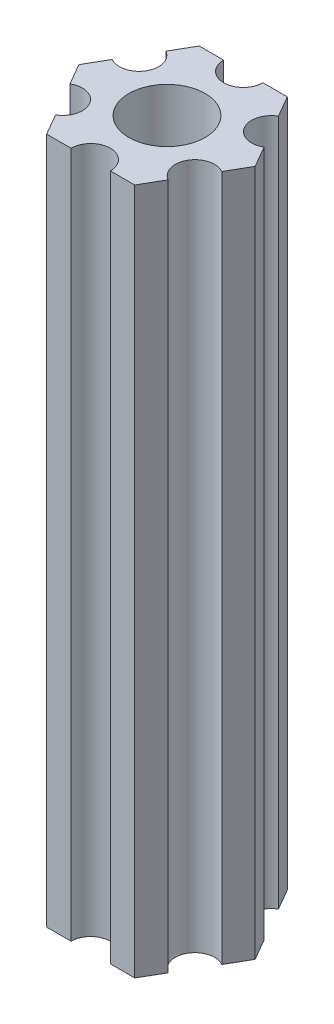
ISO-10303-21;
HEADER;
FILE_DESCRIPTION(('STEP AP214'),'2;1');
FILE_NAME('part.step','',(''),(''),'','','');
FILE_SCHEMA(('AUTOMOTIVE_DESIGN { 1 0 10303 214 1 1 1 1 }'));
ENDSEC;
DATA;
#1=APPLICATION_CONTEXT('core data for automotive mechanical design processes');
#2=APPLICATION_PROTOCOL_DEFINITION('international standard','automotive_design',2000,#1);
#3=PRODUCT_CONTEXT('',#1,'mechanical');
#4=PRODUCT('Part','Part','',(#3));
#5=PRODUCT_RELATED_PRODUCT_CATEGORY('part','',(#4));
#6=PRODUCT_DEFINITION_FORMATION('','',#4);
#7=PRODUCT_DEFINITION_CONTEXT('part definition',#1,'design');
#8=PRODUCT_DEFINITION('design','',#6,#7);
#9=PRODUCT_DEFINITION_SHAPE('','',#8);
#10=(LENGTH_UNIT() NAMED_UNIT(*) SI_UNIT(.MILLI.,.METRE.));
#11=(NAMED_UNIT(*) PLANE_ANGLE_UNIT() SI_UNIT($,.RADIAN.));
#12=(NAMED_UNIT(*) SI_UNIT($,.STERADIAN.) SOLID_ANGLE_UNIT());
#13=UNCERTAINTY_MEASURE_WITH_UNIT(LENGTH_MEASURE(1.E-05),#10,'distance_accuracy_value','');
#14=(GEOMETRIC_REPRESENTATION_CONTEXT(3) GLOBAL_UNCERTAINTY_ASSIGNED_CONTEXT((#13)) GLOBAL_UNIT_ASSIGNED_CONTEXT((#10,
#11,#12)) REPRESENTATION_CONTEXT('',''));
#15=CARTESIAN_POINT('',(0.,0.,0.));
#16=DIRECTION('',(0.,0.,1.));
#17=DIRECTION('',(1.,0.,0.));
#18=AXIS2_PLACEMENT_3D('',#15,#16,#17);
#19=CARTESIAN_POINT('',(-5.49926131403119,0.,-3.175));
#20=DIRECTION('',(0.,-1.,0.));
#21=DIRECTION('',(0.,0.,-1.));
#22=AXIS2_PLACEMENT_3D('',#19,#20,#21);
#23=CYLINDRICAL_SURFACE('',#22,1.63417420935412);
#24=CARTESIAN_POINT('',(-5.49926131403119,-57.15,-3.175));
#25=DIRECTION('',(0.,1.,0.));
#26=DIRECTION('',(0.,0.,1.));
#27=AXIS2_PLACEMENT_3D('',#24,#25,#26);
#28=CIRCLE('',#27,1.63417420935412);
#29=CARTESIAN_POINT('',(-6.31634841870825,-57.15,-1.75976362048998));
#30=VERTEX_POINT('',#29);
#31=CARTESIAN_POINT('',(-4.68217420935413,-57.15,-4.59023637951002));
#32=VERTEX_POINT('',#31);
#33=EDGE_CURVE('E206',#30,#32,#28,.T.);
#34=ORIENTED_EDGE('',*,*,#33,.F.);
#35=DIRECTION('',(0.,-1.,0.));
#36=VECTOR('',#35,1.);
#37=CARTESIAN_POINT('',(-6.31634841870825,0.,-1.75976362048998));
#38=LINE('',#37,#36);
#39=CARTESIAN_POINT('',(-6.31634841870825,0.,-1.75976362048998));
#40=VERTEX_POINT('',#39);
#41=EDGE_CURVE('E11',#40,#30,#38,.T.);
#42=ORIENTED_EDGE('',*,*,#41,.F.);
#43=CARTESIAN_POINT('',(-5.49926131403119,0.,-3.175));
#44=DIRECTION('',(0.,1.,0.));
#45=DIRECTION('',(0.,0.,1.));
#46=AXIS2_PLACEMENT_3D('',#43,#44,#45);
#47=CIRCLE('',#46,1.63417420935412);
#48=CARTESIAN_POINT('',(-4.68217420935413,0.,-4.59023637951002));
#49=VERTEX_POINT('',#48);
#50=EDGE_CURVE('E275',#40,#49,#47,.T.);
#51=ORIENTED_EDGE('',*,*,#50,.T.);
#52=DIRECTION('',(0.,-1.,0.));
#53=VECTOR('',#52,1.);
#54=CARTESIAN_POINT('',(-4.68217420935413,0.,-4.59023637951002));
#55=LINE('',#54,#53);
#56=EDGE_CURVE('E46',#49,#32,#55,.T.);
#57=ORIENTED_EDGE('',*,*,#56,.T.);
#58=EDGE_LOOP('',(#34,#42,#51,#57));
#59=FACE_BOUND('',#58,.T.);
#60=ADVANCED_FACE('F43',(#59),#23,.F.);
#61=CARTESIAN_POINT('',(-7.33234841870825,0.,0.));
#62=DIRECTION('',(-0.866025403784439,0.,-0.5));
#63=DIRECTION('',(-0.5,0.,0.866025403784439));
#64=AXIS2_PLACEMENT_3D('',#61,#62,#63);
#65=PLANE('',#64);
#66=DIRECTION('',(0.5,0.,-0.866025403784439));
#67=VECTOR('',#66,1.);
#68=CARTESIAN_POINT('',(-7.33234841870825,-57.15,0.));
#69=LINE('',#68,#67);
#70=CARTESIAN_POINT('',(-7.33234841870825,-57.15,0.));
#71=VERTEX_POINT('',#70);
#72=EDGE_CURVE('E272',#71,#30,#69,.T.);
#73=ORIENTED_EDGE('',*,*,#72,.F.);
#74=DIRECTION('',(0.,-1.,0.));
#75=VECTOR('',#74,1.);
#76=CARTESIAN_POINT('',(-7.33234841870825,0.,0.));
#77=LINE('',#76,#75);
#78=CARTESIAN_POINT('',(-7.33234841870825,0.,0.));
#79=VERTEX_POINT('',#78);
#80=EDGE_CURVE('E53',#79,#71,#77,.T.);
#81=ORIENTED_EDGE('',*,*,#80,.F.);
#82=DIRECTION('',(0.5,0.,-0.866025403784439));
#83=VECTOR('',#82,1.);
#84=CARTESIAN_POINT('',(-7.33234841870825,0.,0.));
#85=LINE('',#84,#83);
#86=EDGE_CURVE('E192',#79,#40,#85,.T.);
#87=ORIENTED_EDGE('',*,*,#86,.T.);
#88=ORIENTED_EDGE('',*,*,#41,.T.);
#89=EDGE_LOOP('',(#73,#81,#87,#88));
#90=FACE_BOUND('',#89,.T.);
#91=ADVANCED_FACE('F323',(#90),#65,.T.);
#92=CARTESIAN_POINT('',(-6.31634841870825,0.,1.75976362048998));
#93=DIRECTION('',(-0.866025403784439,0.,0.499999999999999));
#94=DIRECTION('',(0.499999999999999,0.,0.866025403784439));
#95=AXIS2_PLACEMENT_3D('',#92,#93,#94);
#96=PLANE('',#95);
#97=DIRECTION('',(-0.499999999999999,0.,-0.866025403784439));
#98=VECTOR('',#97,1.);
#99=CARTESIAN_POINT('',(-6.31634841870825,-57.15,1.75976362048998));
#100=LINE('',#99,#98);
#101=CARTESIAN_POINT('',(-6.31634841870825,-57.15,1.75976362048998));
#102=VERTEX_POINT('',#101);
#103=EDGE_CURVE('E178',#102,#71,#100,.T.);
#104=ORIENTED_EDGE('',*,*,#103,.F.);
#105=DIRECTION('',(0.,-1.,0.));
#106=VECTOR('',#105,1.);
#107=CARTESIAN_POINT('',(-6.31634841870825,0.,1.75976362048998));
#108=LINE('',#107,#106);
#109=CARTESIAN_POINT('',(-6.31634841870825,0.,1.75976362048998));
#110=VERTEX_POINT('',#109);
#111=EDGE_CURVE('E173',#110,#102,#108,.T.);
#112=ORIENTED_EDGE('',*,*,#111,.F.);
#113=DIRECTION('',(-0.499999999999999,0.,-0.866025403784439));
#114=VECTOR('',#113,1.);
#115=CARTESIAN_POINT('',(-6.31634841870825,0.,1.75976362048998));
#116=LINE('',#115,#114);
#117=EDGE_CURVE('E176',#110,#79,#116,.T.);
#118=ORIENTED_EDGE('',*,*,#117,.T.);
#119=ORIENTED_EDGE('',*,*,#80,.T.);
#120=EDGE_LOOP('',(#104,#112,#118,#119));
#121=FACE_BOUND('',#120,.T.);
#122=ADVANCED_FACE('F175',(#121),#96,.T.);
#123=CARTESIAN_POINT('',(-5.49926131403119,0.,3.175));
#124=DIRECTION('',(0.,-1.,0.));
#125=DIRECTION('',(0.,0.,-1.));
#126=AXIS2_PLACEMENT_3D('',#123,#124,#125);
#127=CYLINDRICAL_SURFACE('',#126,1.63417420935412);
#128=CARTESIAN_POINT('',(-5.49926131403119,-57.15,3.175));
#129=DIRECTION('',(0.,1.,0.));
#130=DIRECTION('',(0.,0.,1.));
#131=AXIS2_PLACEMENT_3D('',#128,#129,#130);
#132=CIRCLE('',#131,1.63417420935412);
#133=CARTESIAN_POINT('',(-4.68217420935413,-57.15,4.59023637951002));
#134=VERTEX_POINT('',#133);
#135=EDGE_CURVE('E267',#134,#102,#132,.T.);
#136=ORIENTED_EDGE('',*,*,#135,.F.);
#137=DIRECTION('',(0.,-1.,0.));
#138=VECTOR('',#137,1.);
#139=CARTESIAN_POINT('',(-4.68217420935413,0.,4.59023637951002));
#140=LINE('',#139,#138);
#141=CARTESIAN_POINT('',(-4.68217420935413,0.,4.59023637951002));
#142=VERTEX_POINT('',#141);
#143=EDGE_CURVE('E184',#142,#134,#140,.T.);
#144=ORIENTED_EDGE('',*,*,#143,.F.);
#145=CARTESIAN_POINT('',(-5.49926131403119,0.,3.175));
#146=DIRECTION('',(0.,1.,0.));
#147=DIRECTION('',(0.,0.,1.));
#148=AXIS2_PLACEMENT_3D('',#145,#146,#147);
#149=CIRCLE('',#148,1.63417420935412);
#150=EDGE_CURVE('E190',#142,#110,#149,.T.);
#151=ORIENTED_EDGE('',*,*,#150,.T.);
#152=ORIENTED_EDGE('',*,*,#111,.T.);
#153=EDGE_LOOP('',(#136,#144,#151,#152));
#154=FACE_BOUND('',#153,.T.);
#155=ADVANCED_FACE('F195',(#154),#127,.F.);
#156=CARTESIAN_POINT('',(-3.66617420935412,0.,6.35));
#157=DIRECTION('',(-0.866025403784438,0.,0.500000000000002));
#158=DIRECTION('',(0.500000000000002,0.,0.866025403784438));
#159=AXIS2_PLACEMENT_3D('',#156,#157,#158);
#160=PLANE('',#159);
#161=DIRECTION('',(-0.500000000000002,0.,-0.866025403784437));
#162=VECTOR('',#161,1.);
#163=CARTESIAN_POINT('',(-3.66617420935412,-57.15,6.35));
#164=LINE('',#163,#162);
#165=CARTESIAN_POINT('',(-3.66617420935412,-57.15,6.35));
#166=VERTEX_POINT('',#165);
#167=EDGE_CURVE('E263',#166,#134,#164,.T.);
#168=ORIENTED_EDGE('',*,*,#167,.F.);
#169=DIRECTION('',(0.,-1.,0.));
#170=VECTOR('',#169,1.);
#171=CARTESIAN_POINT('',(-3.66617420935412,0.,6.35));
#172=LINE('',#171,#170);
#173=CARTESIAN_POINT('',(-3.66617420935412,0.,6.35));
#174=VERTEX_POINT('',#173);
#175=EDGE_CURVE('E281',#174,#166,#172,.T.);
#176=ORIENTED_EDGE('',*,*,#175,.F.);
#177=DIRECTION('',(-0.500000000000002,0.,-0.866025403784437));
#178=VECTOR('',#177,1.);
#179=CARTESIAN_POINT('',(-3.66617420935412,0.,6.35));
#180=LINE('',#179,#178);
#181=EDGE_CURVE('E197',#174,#142,#180,.T.);
#182=ORIENTED_EDGE('',*,*,#181,.T.);
#183=ORIENTED_EDGE('',*,*,#143,.T.);
#184=EDGE_LOOP('',(#168,#176,#182,#183));
#185=FACE_BOUND('',#184,.T.);
#186=ADVANCED_FACE('F336',(#185),#160,.T.);
#187=CARTESIAN_POINT('',(-1.63417420935412,0.,6.35));
#188=DIRECTION('',(0.,0.,1.));
#189=DIRECTION('',(1.,0.,0.));
#190=AXIS2_PLACEMENT_3D('',#187,#188,#189);
#191=PLANE('',#190);
#192=DIRECTION('',(-1.,0.,0.));
#193=VECTOR('',#192,1.);
#194=CARTESIAN_POINT('',(-1.63417420935412,-57.15,6.35));
#195=LINE('',#194,#193);
#196=CARTESIAN_POINT('',(-1.63417420935412,-57.15,6.35));
#197=VERTEX_POINT('',#196);
#198=EDGE_CURVE('E259',#197,#166,#195,.T.);
#199=ORIENTED_EDGE('',*,*,#198,.F.);
#200=DIRECTION('',(0.,-1.,0.));
#201=VECTOR('',#200,1.);
#202=CARTESIAN_POINT('',(-1.63417420935412,0.,6.35));
#203=LINE('',#202,#201);
#204=CARTESIAN_POINT('',(-1.63417420935412,0.,6.35));
#205=VERTEX_POINT('',#204);
#206=EDGE_CURVE('E284',#205,#197,#203,.T.);
#207=ORIENTED_EDGE('',*,*,#206,.F.);
#208=DIRECTION('',(-1.,0.,0.));
#209=VECTOR('',#208,1.);
#210=CARTESIAN_POINT('',(-1.63417420935412,0.,6.35));
#211=LINE('',#210,#209);
#212=EDGE_CURVE('E200',#205,#174,#211,.T.);
#213=ORIENTED_EDGE('',*,*,#212,.T.);
#214=ORIENTED_EDGE('',*,*,#175,.T.);
#215=EDGE_LOOP('',(#199,#207,#213,#214));
#216=FACE_BOUND('',#215,.T.);
#217=ADVANCED_FACE('F339',(#216),#191,.T.);
#218=CARTESIAN_POINT('',(0.,0.,6.35));
#219=DIRECTION('',(0.,-1.,0.));
#220=DIRECTION('',(0.,0.,-1.));
#221=AXIS2_PLACEMENT_3D('',#218,#219,#220);
#222=CYLINDRICAL_SURFACE('',#221,1.63417420935412);
#223=CARTESIAN_POINT('',(0.,-57.15,6.35));
#224=DIRECTION('',(0.,1.,0.));
#225=DIRECTION('',(0.,0.,1.));
#226=AXIS2_PLACEMENT_3D('',#223,#224,#225);
#227=CIRCLE('',#226,1.63417420935412);
#228=CARTESIAN_POINT('',(1.63417420935412,-57.15,6.35));
#229=VERTEX_POINT('',#228);
#230=EDGE_CURVE('E255',#229,#197,#227,.T.);
#231=ORIENTED_EDGE('',*,*,#230,.F.);
#232=DIRECTION('',(0.,-1.,0.));
#233=VECTOR('',#232,1.);
#234=CARTESIAN_POINT('',(1.63417420935412,0.,6.35));
#235=LINE('',#234,#233);
#236=CARTESIAN_POINT('',(1.63417420935412,0.,6.35));
#237=VERTEX_POINT('',#236);
#238=EDGE_CURVE('E287',#237,#229,#235,.T.);
#239=ORIENTED_EDGE('',*,*,#238,.F.);
#240=CARTESIAN_POINT('',(0.,0.,6.35));
#241=DIRECTION('',(0.,1.,0.));
#242=DIRECTION('',(0.,0.,1.));
#243=AXIS2_PLACEMENT_3D('',#240,#241,#242);
#244=CIRCLE('',#243,1.63417420935412);
#245=EDGE_CURVE('E458',#237,#205,#244,.T.);
#246=ORIENTED_EDGE('',*,*,#245,.T.);
#247=ORIENTED_EDGE('',*,*,#206,.T.);
#248=EDGE_LOOP('',(#231,#239,#246,#247));
#249=FACE_BOUND('',#248,.T.);
#250=ADVANCED_FACE('F343',(#249),#222,.F.);
#251=CARTESIAN_POINT('',(3.66617420935412,0.,6.35));
#252=DIRECTION('',(0.,0.,1.));
#253=DIRECTION('',(1.,0.,0.));
#254=AXIS2_PLACEMENT_3D('',#251,#252,#253);
#255=PLANE('',#254);
#256=DIRECTION('',(-1.,0.,0.));
#257=VECTOR('',#256,1.);
#258=CARTESIAN_POINT('',(3.66617420935412,-57.15,6.35));
#259=LINE('',#258,#257);
#260=CARTESIAN_POINT('',(3.66617420935412,-57.15,6.35));
#261=VERTEX_POINT('',#260);
#262=EDGE_CURVE('E251',#261,#229,#259,.T.);
#263=ORIENTED_EDGE('',*,*,#262,.F.);
#264=DIRECTION('',(0.,-1.,0.));
#265=VECTOR('',#264,1.);
#266=CARTESIAN_POINT('',(3.66617420935412,0.,6.35));
#267=LINE('',#266,#265);
#268=CARTESIAN_POINT('',(3.66617420935412,0.,6.35));
#269=VERTEX_POINT('',#268);
#270=EDGE_CURVE('E290',#269,#261,#267,.T.);
#271=ORIENTED_EDGE('',*,*,#270,.F.);
#272=DIRECTION('',(-1.,0.,0.));
#273=VECTOR('',#272,1.);
#274=CARTESIAN_POINT('',(3.66617420935412,0.,6.35));
#275=LINE('',#274,#273);
#276=EDGE_CURVE('E454',#269,#237,#275,.T.);
#277=ORIENTED_EDGE('',*,*,#276,.T.);
#278=ORIENTED_EDGE('',*,*,#238,.T.);
#279=EDGE_LOOP('',(#263,#271,#277,#278));
#280=FACE_BOUND('',#279,.T.);
#281=ADVANCED_FACE('F347',(#280),#255,.T.);
#282=CARTESIAN_POINT('',(4.68217420935412,0.,4.59023637951002));
#283=DIRECTION('',(0.866025403784439,0.,0.5));
#284=DIRECTION('',(0.5,0.,-0.866025403784439));
#285=AXIS2_PLACEMENT_3D('',#282,#283,#284);
#286=PLANE('',#285);
#287=DIRECTION('',(-0.5,0.,0.866025403784439));
#288=VECTOR('',#287,1.);
#289=CARTESIAN_POINT('',(4.68217420935412,-57.15,4.59023637951002));
#290=LINE('',#289,#288);
#291=CARTESIAN_POINT('',(4.68217420935412,-57.15,4.59023637951002));
#292=VERTEX_POINT('',#291);
#293=EDGE_CURVE('E247',#292,#261,#290,.T.);
#294=ORIENTED_EDGE('',*,*,#293,.F.);
#295=DIRECTION('',(0.,-1.,0.));
#296=VECTOR('',#295,1.);
#297=CARTESIAN_POINT('',(4.68217420935412,0.,4.59023637951002));
#298=LINE('',#297,#296);
#299=CARTESIAN_POINT('',(4.68217420935412,0.,4.59023637951002));
#300=VERTEX_POINT('',#299);
#301=EDGE_CURVE('E293',#300,#292,#298,.T.);
#302=ORIENTED_EDGE('',*,*,#301,.F.);
#303=DIRECTION('',(-0.5,0.,0.866025403784439));
#304=VECTOR('',#303,1.);
#305=CARTESIAN_POINT('',(4.68217420935412,0.,4.59023637951002));
#306=LINE('',#305,#304);
#307=EDGE_CURVE('E450',#300,#269,#306,.T.);
#308=ORIENTED_EDGE('',*,*,#307,.T.);
#309=ORIENTED_EDGE('',*,*,#270,.T.);
#310=EDGE_LOOP('',(#294,#302,#308,#309));
#311=FACE_BOUND('',#310,.T.);
#312=ADVANCED_FACE('F351',(#311),#286,.T.);
#313=CARTESIAN_POINT('',(5.49926131403119,0.,3.175));
#314=DIRECTION('',(0.,-1.,0.));
#315=DIRECTION('',(0.,0.,-1.));
#316=AXIS2_PLACEMENT_3D('',#313,#314,#315);
#317=CYLINDRICAL_SURFACE('',#316,1.63417420935413);
#318=CARTESIAN_POINT('',(5.49926131403119,-57.15,3.175));
#319=DIRECTION('',(0.,1.,0.));
#320=DIRECTION('',(0.,0.,1.));
#321=AXIS2_PLACEMENT_3D('',#318,#319,#320);
#322=CIRCLE('',#321,1.63417420935413);
#323=CARTESIAN_POINT('',(6.31634841870825,-57.15,1.75976362048998));
#324=VERTEX_POINT('',#323);
#325=EDGE_CURVE('E243',#324,#292,#322,.T.);
#326=ORIENTED_EDGE('',*,*,#325,.F.);
#327=DIRECTION('',(0.,-1.,0.));
#328=VECTOR('',#327,1.);
#329=CARTESIAN_POINT('',(6.31634841870825,0.,1.75976362048998));
#330=LINE('',#329,#328);
#331=CARTESIAN_POINT('',(6.31634841870825,0.,1.75976362048998));
#332=VERTEX_POINT('',#331);
#333=EDGE_CURVE('E296',#332,#324,#330,.T.);
#334=ORIENTED_EDGE('',*,*,#333,.F.);
#335=CARTESIAN_POINT('',(5.49926131403119,0.,3.175));
#336=DIRECTION('',(0.,1.,0.));
#337=DIRECTION('',(0.,0.,1.));
#338=AXIS2_PLACEMENT_3D('',#335,#336,#337);
#339=CIRCLE('',#338,1.63417420935413);
#340=EDGE_CURVE('E446',#332,#300,#339,.T.);
#341=ORIENTED_EDGE('',*,*,#340,.T.);
#342=ORIENTED_EDGE('',*,*,#301,.T.);
#343=EDGE_LOOP('',(#326,#334,#341,#342));
#344=FACE_BOUND('',#343,.T.);
#345=ADVANCED_FACE('F355',(#344),#317,.F.);
#346=CARTESIAN_POINT('',(7.33234841870825,0.,0.));
#347=DIRECTION('',(0.866025403784439,0.,0.5));
#348=DIRECTION('',(0.5,0.,-0.866025403784438));
#349=AXIS2_PLACEMENT_3D('',#346,#347,#348);
#350=PLANE('',#349);
#351=DIRECTION('',(-0.5,0.,0.866025403784438));
#352=VECTOR('',#351,1.);
#353=CARTESIAN_POINT('',(7.33234841870825,-57.15,0.));
#354=LINE('',#353,#352);
#355=CARTESIAN_POINT('',(7.33234841870825,-57.15,0.));
#356=VERTEX_POINT('',#355);
#357=EDGE_CURVE('E239',#356,#324,#354,.T.);
#358=ORIENTED_EDGE('',*,*,#357,.F.);
#359=DIRECTION('',(0.,-1.,0.));
#360=VECTOR('',#359,1.);
#361=CARTESIAN_POINT('',(7.33234841870825,0.,0.));
#362=LINE('',#361,#360);
#363=CARTESIAN_POINT('',(7.33234841870825,0.,0.));
#364=VERTEX_POINT('',#363);
#365=EDGE_CURVE('E299',#364,#356,#362,.T.);
#366=ORIENTED_EDGE('',*,*,#365,.F.);
#367=DIRECTION('',(-0.5,0.,0.866025403784438));
#368=VECTOR('',#367,1.);
#369=CARTESIAN_POINT('',(7.33234841870825,0.,0.));
#370=LINE('',#369,#368);
#371=EDGE_CURVE('E442',#364,#332,#370,.T.);
#372=ORIENTED_EDGE('',*,*,#371,.T.);
#373=ORIENTED_EDGE('',*,*,#333,.T.);
#374=EDGE_LOOP('',(#358,#366,#372,#373));
#375=FACE_BOUND('',#374,.T.);
#376=ADVANCED_FACE('F359',(#375),#350,.T.);
#377=CARTESIAN_POINT('',(6.31634841870825,0.,-1.75976362048998));
#378=DIRECTION('',(0.866025403784439,0.,-0.499999999999999));
#379=DIRECTION('',(-0.499999999999999,0.,-0.866025403784439));
#380=AXIS2_PLACEMENT_3D('',#377,#378,#379);
#381=PLANE('',#380);
#382=DIRECTION('',(0.499999999999999,0.,0.866025403784439));
#383=VECTOR('',#382,1.);
#384=CARTESIAN_POINT('',(6.31634841870825,-57.15,-1.75976362048998));
#385=LINE('',#384,#383);
#386=CARTESIAN_POINT('',(6.31634841870825,-57.15,-1.75976362048998));
#387=VERTEX_POINT('',#386);
#388=EDGE_CURVE('E235',#387,#356,#385,.T.);
#389=ORIENTED_EDGE('',*,*,#388,.F.);
#390=DIRECTION('',(0.,-1.,0.));
#391=VECTOR('',#390,1.);
#392=CARTESIAN_POINT('',(6.31634841870825,0.,-1.75976362048998));
#393=LINE('',#392,#391);
#394=CARTESIAN_POINT('',(6.31634841870825,0.,-1.75976362048998));
#395=VERTEX_POINT('',#394);
#396=EDGE_CURVE('E302',#395,#387,#393,.T.);
#397=ORIENTED_EDGE('',*,*,#396,.F.);
#398=DIRECTION('',(0.499999999999999,0.,0.866025403784439));
#399=VECTOR('',#398,1.);
#400=CARTESIAN_POINT('',(6.31634841870825,0.,-1.75976362048998));
#401=LINE('',#400,#399);
#402=EDGE_CURVE('E438',#395,#364,#401,.T.);
#403=ORIENTED_EDGE('',*,*,#402,.T.);
#404=ORIENTED_EDGE('',*,*,#365,.T.);
#405=EDGE_LOOP('',(#389,#397,#403,#404));
#406=FACE_BOUND('',#405,.T.);
#407=ADVANCED_FACE('F363',(#406),#381,.T.);
#408=CARTESIAN_POINT('',(5.49926131403119,0.,-3.175));
#409=DIRECTION('',(0.,-1.,0.));
#410=DIRECTION('',(0.,0.,-1.));
#411=AXIS2_PLACEMENT_3D('',#408,#409,#410);
#412=CYLINDRICAL_SURFACE('',#411,1.63417420935412);
#413=CARTESIAN_POINT('',(5.49926131403119,-57.15,-3.175));
#414=DIRECTION('',(0.,1.,0.));
#415=DIRECTION('',(0.,0.,1.));
#416=AXIS2_PLACEMENT_3D('',#413,#414,#415);
#417=CIRCLE('',#416,1.63417420935412);
#418=CARTESIAN_POINT('',(4.68217420935413,-57.15,-4.59023637951002));
#419=VERTEX_POINT('',#418);
#420=EDGE_CURVE('E231',#419,#387,#417,.T.);
#421=ORIENTED_EDGE('',*,*,#420,.F.);
#422=DIRECTION('',(0.,-1.,0.));
#423=VECTOR('',#422,1.);
#424=CARTESIAN_POINT('',(4.68217420935413,0.,-4.59023637951002));
#425=LINE('',#424,#423);
#426=CARTESIAN_POINT('',(4.68217420935413,0.,-4.59023637951002));
#427=VERTEX_POINT('',#426);
#428=EDGE_CURVE('E305',#427,#419,#425,.T.);
#429=ORIENTED_EDGE('',*,*,#428,.F.);
#430=CARTESIAN_POINT('',(5.49926131403119,0.,-3.175));
#431=DIRECTION('',(0.,1.,0.));
#432=DIRECTION('',(0.,0.,1.));
#433=AXIS2_PLACEMENT_3D('',#430,#431,#432);
#434=CIRCLE('',#433,1.63417420935412);
#435=EDGE_CURVE('E434',#427,#395,#434,.T.);
#436=ORIENTED_EDGE('',*,*,#435,.T.);
#437=ORIENTED_EDGE('',*,*,#396,.T.);
#438=EDGE_LOOP('',(#421,#429,#436,#437));
#439=FACE_BOUND('',#438,.T.);
#440=ADVANCED_FACE('F367',(#439),#412,.F.);
#441=CARTESIAN_POINT('',(3.66617420935412,0.,-6.35));
#442=DIRECTION('',(0.866025403784438,0.,-0.500000000000002));
#443=DIRECTION('',(-0.500000000000002,0.,-0.866025403784438));
#444=AXIS2_PLACEMENT_3D('',#441,#442,#443);
#445=PLANE('',#444);
#446=DIRECTION('',(0.500000000000002,0.,0.866025403784437));
#447=VECTOR('',#446,1.);
#448=CARTESIAN_POINT('',(3.66617420935412,-57.15,-6.35));
#449=LINE('',#448,#447);
#450=CARTESIAN_POINT('',(3.66617420935412,-57.15,-6.35));
#451=VERTEX_POINT('',#450);
#452=EDGE_CURVE('E227',#451,#419,#449,.T.);
#453=ORIENTED_EDGE('',*,*,#452,.F.);
#454=DIRECTION('',(0.,-1.,0.));
#455=VECTOR('',#454,1.);
#456=CARTESIAN_POINT('',(3.66617420935412,0.,-6.35));
#457=LINE('',#456,#455);
#458=CARTESIAN_POINT('',(3.66617420935412,0.,-6.35));
#459=VERTEX_POINT('',#458);
#460=EDGE_CURVE('E308',#459,#451,#457,.T.);
#461=ORIENTED_EDGE('',*,*,#460,.F.);
#462=DIRECTION('',(0.500000000000002,0.,0.866025403784437));
#463=VECTOR('',#462,1.);
#464=CARTESIAN_POINT('',(3.66617420935412,0.,-6.35));
#465=LINE('',#464,#463);
#466=EDGE_CURVE('E430',#459,#427,#465,.T.);
#467=ORIENTED_EDGE('',*,*,#466,.T.);
#468=ORIENTED_EDGE('',*,*,#428,.T.);
#469=EDGE_LOOP('',(#453,#461,#467,#468));
#470=FACE_BOUND('',#469,.T.);
#471=ADVANCED_FACE('F371',(#470),#445,.T.);
#472=CARTESIAN_POINT('',(1.63417420935412,0.,-6.35));
#473=DIRECTION('',(0.,0.,-1.));
#474=DIRECTION('',(-1.,0.,0.));
#475=AXIS2_PLACEMENT_3D('',#472,#473,#474);
#476=PLANE('',#475);
#477=DIRECTION('',(1.,0.,0.));
#478=VECTOR('',#477,1.);
#479=CARTESIAN_POINT('',(1.63417420935412,-57.15,-6.35));
#480=LINE('',#479,#478);
#481=CARTESIAN_POINT('',(1.63417420935412,-57.15,-6.35));
#482=VERTEX_POINT('',#481);
#483=EDGE_CURVE('E223',#482,#451,#480,.T.);
#484=ORIENTED_EDGE('',*,*,#483,.F.);
#485=DIRECTION('',(0.,-1.,0.));
#486=VECTOR('',#485,1.);
#487=CARTESIAN_POINT('',(1.63417420935412,0.,-6.35));
#488=LINE('',#487,#486);
#489=CARTESIAN_POINT('',(1.63417420935412,0.,-6.35));
#490=VERTEX_POINT('',#489);
#491=EDGE_CURVE('E311',#490,#482,#488,.T.);
#492=ORIENTED_EDGE('',*,*,#491,.F.);
#493=DIRECTION('',(1.,0.,0.));
#494=VECTOR('',#493,1.);
#495=CARTESIAN_POINT('',(1.63417420935412,0.,-6.35));
#496=LINE('',#495,#494);
#497=EDGE_CURVE('E426',#490,#459,#496,.T.);
#498=ORIENTED_EDGE('',*,*,#497,.T.);
#499=ORIENTED_EDGE('',*,*,#460,.T.);
#500=EDGE_LOOP('',(#484,#492,#498,#499));
#501=FACE_BOUND('',#500,.T.);
#502=ADVANCED_FACE('F375',(#501),#476,.T.);
#503=CARTESIAN_POINT('',(0.,0.,-6.35));
#504=DIRECTION('',(0.,-1.,0.));
#505=DIRECTION('',(0.,0.,-1.));
#506=AXIS2_PLACEMENT_3D('',#503,#504,#505);
#507=CYLINDRICAL_SURFACE('',#506,1.63417420935412);
#508=CARTESIAN_POINT('',(0.,-57.15,-6.35));
#509=DIRECTION('',(0.,1.,0.));
#510=DIRECTION('',(0.,0.,1.));
#511=AXIS2_PLACEMENT_3D('',#508,#509,#510);
#512=CIRCLE('',#511,1.63417420935412);
#513=CARTESIAN_POINT('',(-1.63417420935413,-57.15,-6.35));
#514=VERTEX_POINT('',#513);
#515=EDGE_CURVE('E219',#514,#482,#512,.T.);
#516=ORIENTED_EDGE('',*,*,#515,.F.);
#517=DIRECTION('',(0.,-1.,0.));
#518=VECTOR('',#517,1.);
#519=CARTESIAN_POINT('',(-1.63417420935413,0.,-6.35));
#520=LINE('',#519,#518);
#521=CARTESIAN_POINT('',(-1.63417420935413,0.,-6.35));
#522=VERTEX_POINT('',#521);
#523=EDGE_CURVE('E314',#522,#514,#520,.T.);
#524=ORIENTED_EDGE('',*,*,#523,.F.);
#525=CARTESIAN_POINT('',(0.,0.,-6.35));
#526=DIRECTION('',(0.,1.,0.));
#527=DIRECTION('',(0.,0.,1.));
#528=AXIS2_PLACEMENT_3D('',#525,#526,#527);
#529=CIRCLE('',#528,1.63417420935412);
#530=EDGE_CURVE('E422',#522,#490,#529,.T.);
#531=ORIENTED_EDGE('',*,*,#530,.T.);
#532=ORIENTED_EDGE('',*,*,#491,.T.);
#533=EDGE_LOOP('',(#516,#524,#531,#532));
#534=FACE_BOUND('',#533,.T.);
#535=ADVANCED_FACE('F379',(#534),#507,.F.);
#536=CARTESIAN_POINT('',(-3.66617420935412,0.,-6.35));
#537=DIRECTION('',(0.,0.,-1.));
#538=DIRECTION('',(-1.,0.,0.));
#539=AXIS2_PLACEMENT_3D('',#536,#537,#538);
#540=PLANE('',#539);
#541=DIRECTION('',(1.,0.,0.));
#542=VECTOR('',#541,1.);
#543=CARTESIAN_POINT('',(-3.66617420935412,-57.15,-6.35));
#544=LINE('',#543,#542);
#545=CARTESIAN_POINT('',(-3.66617420935412,-57.15,-6.35));
#546=VERTEX_POINT('',#545);
#547=EDGE_CURVE('E215',#546,#514,#544,.T.);
#548=ORIENTED_EDGE('',*,*,#547,.F.);
#549=DIRECTION('',(0.,-1.,0.));
#550=VECTOR('',#549,1.);
#551=CARTESIAN_POINT('',(-3.66617420935412,0.,-6.35));
#552=LINE('',#551,#550);
#553=CARTESIAN_POINT('',(-3.66617420935412,0.,-6.35));
#554=VERTEX_POINT('',#553);
#555=EDGE_CURVE('E316',#554,#546,#552,.T.);
#556=ORIENTED_EDGE('',*,*,#555,.F.);
#557=DIRECTION('',(1.,0.,0.));
#558=VECTOR('',#557,1.);
#559=CARTESIAN_POINT('',(-3.66617420935412,0.,-6.35));
#560=LINE('',#559,#558);
#561=EDGE_CURVE('E418',#554,#522,#560,.T.);
#562=ORIENTED_EDGE('',*,*,#561,.T.);
#563=ORIENTED_EDGE('',*,*,#523,.T.);
#564=EDGE_LOOP('',(#548,#556,#562,#563));
#565=FACE_BOUND('',#564,.T.);
#566=ADVANCED_FACE('F383',(#565),#540,.T.);
#567=CARTESIAN_POINT('',(-4.68217420935413,0.,-4.59023637951002));
#568=DIRECTION('',(-0.866025403784436,0.,-0.500000000000004));
#569=DIRECTION('',(-0.500000000000004,0.,0.866025403784436));
#570=AXIS2_PLACEMENT_3D('',#567,#568,#569);
#571=PLANE('',#570);
#572=DIRECTION('',(0.500000000000004,0.,-0.866025403784436));
#573=VECTOR('',#572,1.);
#574=CARTESIAN_POINT('',(-4.68217420935413,-57.15,-4.59023637951002));
#575=LINE('',#574,#573);
#576=EDGE_CURVE('E210',#32,#546,#575,.T.);
#577=ORIENTED_EDGE('',*,*,#576,.F.);
#578=ORIENTED_EDGE('',*,*,#56,.F.);
#579=DIRECTION('',(0.500000000000004,0.,-0.866025403784436));
#580=VECTOR('',#579,1.);
#581=CARTESIAN_POINT('',(-4.68217420935413,0.,-4.59023637951002));
#582=LINE('',#581,#580);
#583=EDGE_CURVE('E415',#49,#554,#582,.T.);
#584=ORIENTED_EDGE('',*,*,#583,.T.);
#585=ORIENTED_EDGE('',*,*,#555,.T.);
#586=EDGE_LOOP('',(#577,#578,#584,#585));
#587=FACE_BOUND('',#586,.T.);
#588=ADVANCED_FACE('F320',(#587),#571,.T.);
#589=CARTESIAN_POINT('',(-5.49926131403119,0.,-3.175));
#590=DIRECTION('',(0.,1.,0.));
#591=DIRECTION('',(0.,0.,1.));
#592=AXIS2_PLACEMENT_3D('',#589,#590,#591);
#593=PLANE('',#592);
#594=CARTESIAN_POINT('',(0.,0.,0.));
#595=DIRECTION('',(0.,-1.,0.));
#596=DIRECTION('',(0.,0.,1.));
#597=AXIS2_PLACEMENT_3D('',#594,#595,#596);
#598=CIRCLE('',#597,3.175);
#599=CARTESIAN_POINT('',(0.,0.,3.175));
#600=VERTEX_POINT('',#599);
#601=EDGE_CURVE('E211',#600,#600,#598,.T.);
#602=ORIENTED_EDGE('',*,*,#601,.T.);
#603=EDGE_LOOP('',(#602));
#604=FACE_BOUND('',#603,.T.);
#605=ORIENTED_EDGE('',*,*,#50,.F.);
#606=ORIENTED_EDGE('',*,*,#86,.F.);
#607=ORIENTED_EDGE('',*,*,#117,.F.);
#608=ORIENTED_EDGE('',*,*,#150,.F.);
#609=ORIENTED_EDGE('',*,*,#181,.F.);
#610=ORIENTED_EDGE('',*,*,#212,.F.);
#611=ORIENTED_EDGE('',*,*,#245,.F.);
#612=ORIENTED_EDGE('',*,*,#276,.F.);
#613=ORIENTED_EDGE('',*,*,#307,.F.);
#614=ORIENTED_EDGE('',*,*,#340,.F.);
#615=ORIENTED_EDGE('',*,*,#371,.F.);
#616=ORIENTED_EDGE('',*,*,#402,.F.);
#617=ORIENTED_EDGE('',*,*,#435,.F.);
#618=ORIENTED_EDGE('',*,*,#466,.F.);
#619=ORIENTED_EDGE('',*,*,#497,.F.);
#620=ORIENTED_EDGE('',*,*,#530,.F.);
#621=ORIENTED_EDGE('',*,*,#561,.F.);
#622=ORIENTED_EDGE('',*,*,#583,.F.);
#623=EDGE_LOOP('',(#605,#606,#607,#608,#609,#610,#611,#612,#613,#614,#615,#616,#617,#618,#619,
#620,#621,#622));
#624=FACE_BOUND('',#623,.T.);
#625=ADVANCED_FACE('F188',(#604,#624),#593,.T.);
#626=CARTESIAN_POINT('',(-5.49926131403119,-57.15,-3.175));
#627=DIRECTION('',(0.,1.,0.));
#628=DIRECTION('',(0.,0.,1.));
#629=AXIS2_PLACEMENT_3D('',#626,#627,#628);
#630=PLANE('',#629);
#631=CARTESIAN_POINT('',(0.,-57.15,0.));
#632=DIRECTION('',(0.,-1.,0.));
#633=DIRECTION('',(0.,0.,1.));
#634=AXIS2_PLACEMENT_3D('',#631,#632,#633);
#635=CIRCLE('',#634,3.175);
#636=CARTESIAN_POINT('',(0.,-57.15,3.175));
#637=VERTEX_POINT('',#636);
#638=EDGE_CURVE('E407',#637,#637,#635,.T.);
#639=ORIENTED_EDGE('',*,*,#638,.F.);
#640=EDGE_LOOP('',(#639));
#641=FACE_BOUND('',#640,.T.);
#642=ORIENTED_EDGE('',*,*,#33,.T.);
#643=ORIENTED_EDGE('',*,*,#576,.T.);
#644=ORIENTED_EDGE('',*,*,#547,.T.);
#645=ORIENTED_EDGE('',*,*,#515,.T.);
#646=ORIENTED_EDGE('',*,*,#483,.T.);
#647=ORIENTED_EDGE('',*,*,#452,.T.);
#648=ORIENTED_EDGE('',*,*,#420,.T.);
#649=ORIENTED_EDGE('',*,*,#388,.T.);
#650=ORIENTED_EDGE('',*,*,#357,.T.);
#651=ORIENTED_EDGE('',*,*,#325,.T.);
#652=ORIENTED_EDGE('',*,*,#293,.T.);
#653=ORIENTED_EDGE('',*,*,#262,.T.);
#654=ORIENTED_EDGE('',*,*,#230,.T.);
#655=ORIENTED_EDGE('',*,*,#198,.T.);
#656=ORIENTED_EDGE('',*,*,#167,.T.);
#657=ORIENTED_EDGE('',*,*,#135,.T.);
#658=ORIENTED_EDGE('',*,*,#103,.T.);
#659=ORIENTED_EDGE('',*,*,#72,.T.);
#660=EDGE_LOOP('',(#642,#643,#644,#645,#646,#647,#648,#649,#650,#651,#652,#653,#654,#655,#656,
#657,#658,#659));
#661=FACE_BOUND('',#660,.T.);
#662=ADVANCED_FACE('F322',(#641,#661),#630,.F.);
#663=CARTESIAN_POINT('',(0.,0.,0.));
#664=DIRECTION('',(0.,-1.,0.));
#665=DIRECTION('',(0.,0.,-1.));
#666=AXIS2_PLACEMENT_3D('',#663,#664,#665);
#667=CYLINDRICAL_SURFACE('',#666,3.175);
#668=ORIENTED_EDGE('',*,*,#601,.F.);
#669=EDGE_LOOP('',(#668));
#670=FACE_BOUND('',#669,.T.);
#671=ORIENTED_EDGE('',*,*,#638,.T.);
#672=EDGE_LOOP('',(#671));
#673=FACE_BOUND('',#672,.T.);
#674=ADVANCED_FACE('F395',(#670,#673),#667,.F.);
#675=CLOSED_SHELL('',(#60,#91,#122,#155,#186,#217,#250,#281,#312,#345,#376,#407,#440,#471,#502,
#535,#566,#588,#625,#662,#674));
#676=MANIFOLD_SOLID_BREP('B2',#675);
#677=ADVANCED_BREP_SHAPE_REPRESENTATION('',(#18,#676),#14);
#678=SHAPE_DEFINITION_REPRESENTATION(#9,#677);
ENDSEC;
END-ISO-10303-21;
